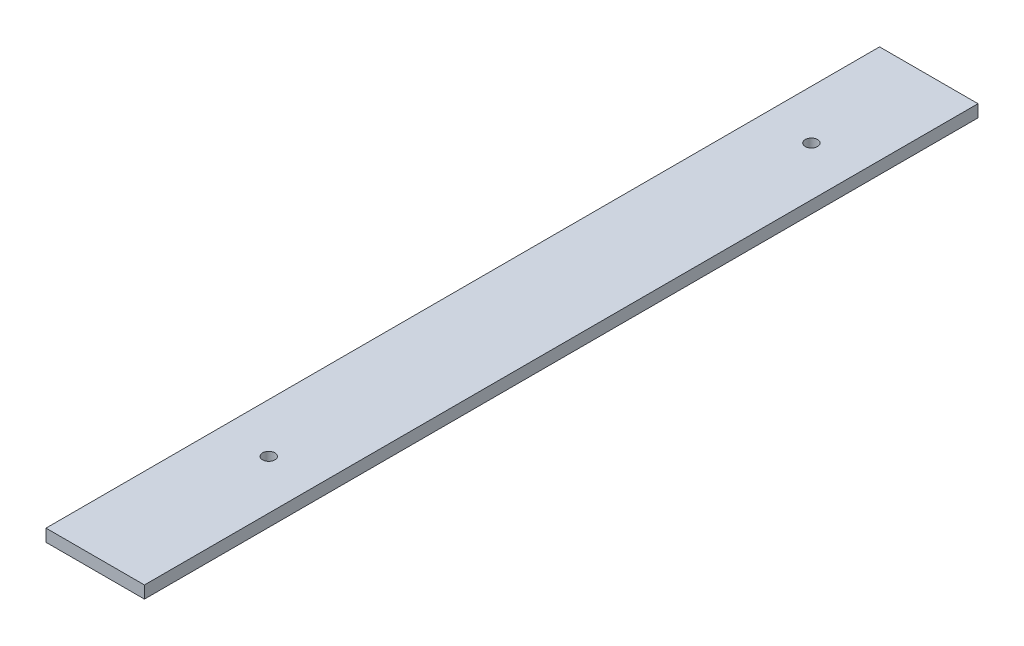
ISO-10303-21;
HEADER;
FILE_DESCRIPTION(('STEP AP214'),'2;1');
FILE_NAME('part.step','',(''),(''),'','','');
FILE_SCHEMA(('AUTOMOTIVE_DESIGN { 1 0 10303 214 1 1 1 1 }'));
ENDSEC;
DATA;
#1=APPLICATION_CONTEXT('core data for automotive mechanical design processes');
#2=APPLICATION_PROTOCOL_DEFINITION('international standard','automotive_design',2000,#1);
#3=PRODUCT_CONTEXT('',#1,'mechanical');
#4=PRODUCT('Part','Part','',(#3));
#5=PRODUCT_RELATED_PRODUCT_CATEGORY('part','',(#4));
#6=PRODUCT_DEFINITION_FORMATION('','',#4);
#7=PRODUCT_DEFINITION_CONTEXT('part definition',#1,'design');
#8=PRODUCT_DEFINITION('design','',#6,#7);
#9=PRODUCT_DEFINITION_SHAPE('','',#8);
#10=(LENGTH_UNIT() NAMED_UNIT(*) SI_UNIT(.MILLI.,.METRE.));
#11=(NAMED_UNIT(*) PLANE_ANGLE_UNIT() SI_UNIT($,.RADIAN.));
#12=(NAMED_UNIT(*) SI_UNIT($,.STERADIAN.) SOLID_ANGLE_UNIT());
#13=UNCERTAINTY_MEASURE_WITH_UNIT(LENGTH_MEASURE(1.E-05),#10,'distance_accuracy_value','');
#14=(GEOMETRIC_REPRESENTATION_CONTEXT(3) GLOBAL_UNCERTAINTY_ASSIGNED_CONTEXT((#13)) GLOBAL_UNIT_ASSIGNED_CONTEXT((#10,
#11,#12)) REPRESENTATION_CONTEXT('',''));
#15=CARTESIAN_POINT('',(0.,0.,0.));
#16=DIRECTION('',(0.,0.,1.));
#17=DIRECTION('',(1.,0.,0.));
#18=AXIS2_PLACEMENT_3D('',#15,#16,#17);
#19=CARTESIAN_POINT('',(0.,25.,0.));
#20=DIRECTION('',(0.,-1.,0.));
#21=DIRECTION('',(0.,0.,-1.));
#22=AXIS2_PLACEMENT_3D('',#19,#20,#21);
#23=PLANE('',#22);
#24=DIRECTION('',(0.,0.,-1.));
#25=VECTOR('',#24,1.);
#26=CARTESIAN_POINT('',(18902.9446458133,25.,9942.5828739722));
#27=LINE('',#26,#25);
#28=CARTESIAN_POINT('',(18902.9446458133,25.,11636.2194573529));
#29=VERTEX_POINT('',#28);
#30=CARTESIAN_POINT('',(18902.9446458133,25.,9942.5828739722));
#31=VERTEX_POINT('',#30);
#32=EDGE_CURVE('E102',#29,#31,#27,.T.);
#33=ORIENTED_EDGE('',*,*,#32,.T.);
#34=DIRECTION('',(-1.,0.,0.));
#35=VECTOR('',#34,1.);
#36=CARTESIAN_POINT('',(18902.9446458133,25.,9942.5828739722));
#37=LINE('',#36,#35);
#38=CARTESIAN_POINT('',(18702.9446458133,25.,9942.5828739722));
#39=VERTEX_POINT('',#38);
#40=EDGE_CURVE('E97',#31,#39,#37,.T.);
#41=ORIENTED_EDGE('',*,*,#40,.T.);
#42=DIRECTION('',(0.,0.,1.));
#43=VECTOR('',#42,1.);
#44=CARTESIAN_POINT('',(18702.9446458133,25.,9942.5828739722));
#45=LINE('',#44,#43);
#46=CARTESIAN_POINT('',(18702.9446458133,25.,11636.2194573529));
#47=VERTEX_POINT('',#46);
#48=EDGE_CURVE('E100',#39,#47,#45,.T.);
#49=ORIENTED_EDGE('',*,*,#48,.T.);
#50=DIRECTION('',(1.,0.,0.));
#51=VECTOR('',#50,1.);
#52=CARTESIAN_POINT('',(18902.9446458133,25.,11636.2194573529));
#53=LINE('',#52,#51);
#54=EDGE_CURVE('E67',#47,#29,#53,.T.);
#55=ORIENTED_EDGE('',*,*,#54,.T.);
#56=EDGE_LOOP('',(#33,#41,#49,#55));
#57=FACE_BOUND('',#56,.T.);
#58=CARTESIAN_POINT('',(18802.9446458133,25.,11283.6697787735));
#59=DIRECTION('',(0.,1.,0.));
#60=DIRECTION('',(0.,0.,1.));
#61=AXIS2_PLACEMENT_3D('',#58,#59,#60);
#62=CIRCLE('',#61,12.4999999999988);
#63=CARTESIAN_POINT('',(18802.9446458133,25.,11296.1697787735));
#64=VERTEX_POINT('',#63);
#65=EDGE_CURVE('E117',#64,#64,#62,.T.);
#66=ORIENTED_EDGE('',*,*,#65,.F.);
#67=EDGE_LOOP('',(#66));
#68=FACE_BOUND('',#67,.T.);
#69=CARTESIAN_POINT('',(18802.9446458133,25.,10181.0304593336));
#70=DIRECTION('',(0.,1.,0.));
#71=DIRECTION('',(0.,0.,1.));
#72=AXIS2_PLACEMENT_3D('',#69,#70,#71);
#73=CIRCLE('',#72,12.4999999999988);
#74=CARTESIAN_POINT('',(18802.9446458133,25.,10193.5304593336));
#75=VERTEX_POINT('',#74);
#76=EDGE_CURVE('E132',#75,#75,#73,.T.);
#77=ORIENTED_EDGE('',*,*,#76,.F.);
#78=EDGE_LOOP('',(#77));
#79=FACE_BOUND('',#78,.T.);
#80=ADVANCED_FACE('F50',(#57,#68,#79),#23,.F.);
#81=CARTESIAN_POINT('',(0.,0.,0.));
#82=DIRECTION('',(0.,-1.,0.));
#83=DIRECTION('',(0.,0.,-1.));
#84=AXIS2_PLACEMENT_3D('',#81,#82,#83);
#85=PLANE('',#84);
#86=CARTESIAN_POINT('',(18802.9446458133,0.,11283.6697787735));
#87=DIRECTION('',(0.,1.,0.));
#88=DIRECTION('',(0.,0.,1.));
#89=AXIS2_PLACEMENT_3D('',#86,#87,#88);
#90=CIRCLE('',#89,12.4999999999988);
#91=CARTESIAN_POINT('',(18802.9446458133,0.,11296.1697787735));
#92=VERTEX_POINT('',#91);
#93=EDGE_CURVE('E129',#92,#92,#90,.T.);
#94=ORIENTED_EDGE('',*,*,#93,.T.);
#95=EDGE_LOOP('',(#94));
#96=FACE_BOUND('',#95,.T.);
#97=DIRECTION('',(0.,0.,-1.));
#98=VECTOR('',#97,1.);
#99=CARTESIAN_POINT('',(18902.9446458133,0.,9942.5828739722));
#100=LINE('',#99,#98);
#101=CARTESIAN_POINT('',(18902.9446458133,0.,11636.2194573529));
#102=VERTEX_POINT('',#101);
#103=CARTESIAN_POINT('',(18902.9446458133,0.,9942.5828739722));
#104=VERTEX_POINT('',#103);
#105=EDGE_CURVE('E114',#102,#104,#100,.T.);
#106=ORIENTED_EDGE('',*,*,#105,.F.);
#107=DIRECTION('',(1.,0.,0.));
#108=VECTOR('',#107,1.);
#109=CARTESIAN_POINT('',(18902.9446458133,0.,11636.2194573529));
#110=LINE('',#109,#108);
#111=CARTESIAN_POINT('',(18702.9446458133,0.,11636.2194573529));
#112=VERTEX_POINT('',#111);
#113=EDGE_CURVE('E90',#112,#102,#110,.T.);
#114=ORIENTED_EDGE('',*,*,#113,.F.);
#115=DIRECTION('',(0.,0.,1.));
#116=VECTOR('',#115,1.);
#117=CARTESIAN_POINT('',(18702.9446458133,0.,9942.5828739722));
#118=LINE('',#117,#116);
#119=CARTESIAN_POINT('',(18702.9446458133,0.,9942.5828739722));
#120=VERTEX_POINT('',#119);
#121=EDGE_CURVE('E84',#120,#112,#118,.T.);
#122=ORIENTED_EDGE('',*,*,#121,.F.);
#123=DIRECTION('',(-1.,0.,0.));
#124=VECTOR('',#123,1.);
#125=CARTESIAN_POINT('',(18902.9446458133,0.,9942.5828739722));
#126=LINE('',#125,#124);
#127=EDGE_CURVE('E106',#104,#120,#126,.T.);
#128=ORIENTED_EDGE('',*,*,#127,.F.);
#129=EDGE_LOOP('',(#106,#114,#122,#128));
#130=FACE_BOUND('',#129,.T.);
#131=CARTESIAN_POINT('',(18802.9446458133,0.,10181.0304593336));
#132=DIRECTION('',(0.,1.,0.));
#133=DIRECTION('',(0.,0.,1.));
#134=AXIS2_PLACEMENT_3D('',#131,#132,#133);
#135=CIRCLE('',#134,12.4999999999988);
#136=CARTESIAN_POINT('',(18802.9446458133,0.,10193.5304593336));
#137=VERTEX_POINT('',#136);
#138=EDGE_CURVE('E135',#137,#137,#135,.T.);
#139=ORIENTED_EDGE('',*,*,#138,.T.);
#140=EDGE_LOOP('',(#139));
#141=FACE_BOUND('',#140,.T.);
#142=ADVANCED_FACE('F125',(#96,#130,#141),#85,.T.);
#143=CARTESIAN_POINT('',(18902.9446458133,25.,9942.5828739722));
#144=DIRECTION('',(-1.,0.,0.));
#145=DIRECTION('',(0.,0.,1.));
#146=AXIS2_PLACEMENT_3D('',#143,#144,#145);
#147=PLANE('',#146);
#148=ORIENTED_EDGE('',*,*,#105,.T.);
#149=DIRECTION('',(0.,-1.,0.));
#150=VECTOR('',#149,1.);
#151=CARTESIAN_POINT('',(18902.9446458133,25.,9942.5828739722));
#152=LINE('',#151,#150);
#153=EDGE_CURVE('E13',#31,#104,#152,.T.);
#154=ORIENTED_EDGE('',*,*,#153,.F.);
#155=ORIENTED_EDGE('',*,*,#32,.F.);
#156=DIRECTION('',(0.,-1.,0.));
#157=VECTOR('',#156,1.);
#158=CARTESIAN_POINT('',(18902.9446458133,25.,11636.2194573529));
#159=LINE('',#158,#157);
#160=EDGE_CURVE('E110',#29,#102,#159,.T.);
#161=ORIENTED_EDGE('',*,*,#160,.T.);
#162=EDGE_LOOP('',(#148,#154,#155,#161));
#163=FACE_BOUND('',#162,.T.);
#164=ADVANCED_FACE('F52',(#163),#147,.F.);
#165=CARTESIAN_POINT('',(18902.9446458133,25.,9942.5828739722));
#166=DIRECTION('',(0.,0.,1.));
#167=DIRECTION('',(1.,0.,0.));
#168=AXIS2_PLACEMENT_3D('',#165,#166,#167);
#169=PLANE('',#168);
#170=ORIENTED_EDGE('',*,*,#127,.T.);
#171=DIRECTION('',(0.,-1.,0.));
#172=VECTOR('',#171,1.);
#173=CARTESIAN_POINT('',(18702.9446458133,25.,9942.5828739722));
#174=LINE('',#173,#172);
#175=EDGE_CURVE('E59',#39,#120,#174,.T.);
#176=ORIENTED_EDGE('',*,*,#175,.F.);
#177=ORIENTED_EDGE('',*,*,#40,.F.);
#178=ORIENTED_EDGE('',*,*,#153,.T.);
#179=EDGE_LOOP('',(#170,#176,#177,#178));
#180=FACE_BOUND('',#179,.T.);
#181=ADVANCED_FACE('F105',(#180),#169,.F.);
#182=CARTESIAN_POINT('',(18702.9446458133,25.,9942.5828739722));
#183=DIRECTION('',(1.,0.,0.));
#184=DIRECTION('',(0.,0.,-1.));
#185=AXIS2_PLACEMENT_3D('',#182,#183,#184);
#186=PLANE('',#185);
#187=ORIENTED_EDGE('',*,*,#121,.T.);
#188=DIRECTION('',(0.,-1.,0.));
#189=VECTOR('',#188,1.);
#190=CARTESIAN_POINT('',(18702.9446458133,25.,11636.2194573529));
#191=LINE('',#190,#189);
#192=EDGE_CURVE('E107',#47,#112,#191,.T.);
#193=ORIENTED_EDGE('',*,*,#192,.F.);
#194=ORIENTED_EDGE('',*,*,#48,.F.);
#195=ORIENTED_EDGE('',*,*,#175,.T.);
#196=EDGE_LOOP('',(#187,#193,#194,#195));
#197=FACE_BOUND('',#196,.T.);
#198=ADVANCED_FACE('F108',(#197),#186,.F.);
#199=CARTESIAN_POINT('',(18902.9446458133,25.,11636.2194573529));
#200=DIRECTION('',(0.,0.,-1.));
#201=DIRECTION('',(-1.,0.,0.));
#202=AXIS2_PLACEMENT_3D('',#199,#200,#201);
#203=PLANE('',#202);
#204=ORIENTED_EDGE('',*,*,#113,.T.);
#205=ORIENTED_EDGE('',*,*,#160,.F.);
#206=ORIENTED_EDGE('',*,*,#54,.F.);
#207=ORIENTED_EDGE('',*,*,#192,.T.);
#208=EDGE_LOOP('',(#204,#205,#206,#207));
#209=FACE_BOUND('',#208,.T.);
#210=ADVANCED_FACE('F122',(#209),#203,.F.);
#211=CARTESIAN_POINT('',(18802.9446458133,25.,11283.6697787735));
#212=DIRECTION('',(0.,-1.,0.));
#213=DIRECTION('',(0.,0.,-1.));
#214=AXIS2_PLACEMENT_3D('',#211,#212,#213);
#215=CYLINDRICAL_SURFACE('',#214,12.4999999999988);
#216=ORIENTED_EDGE('',*,*,#65,.T.);
#217=EDGE_LOOP('',(#216));
#218=FACE_BOUND('',#217,.T.);
#219=ORIENTED_EDGE('',*,*,#93,.F.);
#220=EDGE_LOOP('',(#219));
#221=FACE_BOUND('',#220,.T.);
#222=ADVANCED_FACE('F152',(#218,#221),#215,.F.);
#223=CARTESIAN_POINT('',(18802.9446458133,25.,10181.0304593336));
#224=DIRECTION('',(0.,-1.,0.));
#225=DIRECTION('',(0.,0.,-1.));
#226=AXIS2_PLACEMENT_3D('',#223,#224,#225);
#227=CYLINDRICAL_SURFACE('',#226,12.4999999999988);
#228=ORIENTED_EDGE('',*,*,#76,.T.);
#229=EDGE_LOOP('',(#228));
#230=FACE_BOUND('',#229,.T.);
#231=ORIENTED_EDGE('',*,*,#138,.F.);
#232=EDGE_LOOP('',(#231));
#233=FACE_BOUND('',#232,.T.);
#234=ADVANCED_FACE('F141',(#230,#233),#227,.F.);
#235=CLOSED_SHELL('',(#80,#142,#164,#181,#198,#210,#222,#234));
#236=MANIFOLD_SOLID_BREP('B2',#235);
#237=ADVANCED_BREP_SHAPE_REPRESENTATION('',(#18,#236),#14);
#238=SHAPE_DEFINITION_REPRESENTATION(#9,#237);
ENDSEC;
END-ISO-10303-21;
